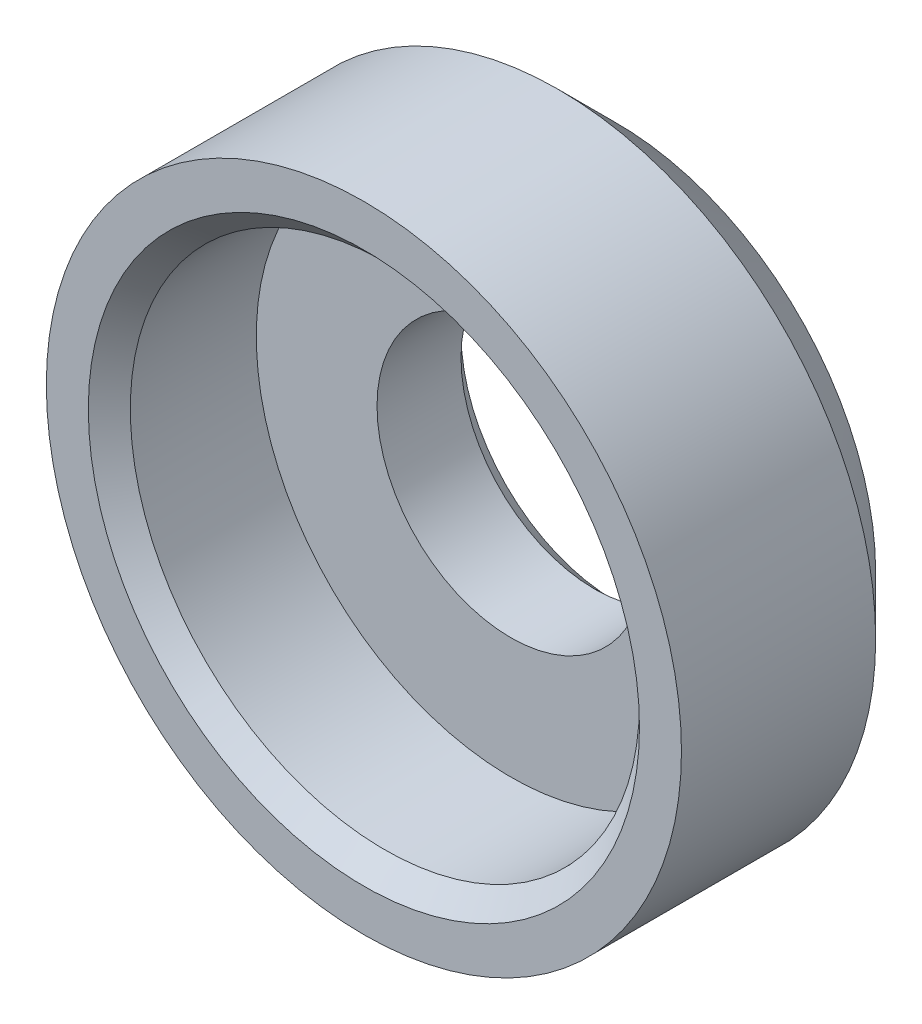
ISO-10303-21;
HEADER;
FILE_DESCRIPTION(('STEP AP214'),'2;1');
FILE_NAME('part.step','',(''),(''),'','','');
FILE_SCHEMA(('AUTOMOTIVE_DESIGN { 1 0 10303 214 1 1 1 1 }'));
ENDSEC;
DATA;
#1=APPLICATION_CONTEXT('core data for automotive mechanical design processes');
#2=APPLICATION_PROTOCOL_DEFINITION('international standard','automotive_design',2000,#1);
#3=PRODUCT_CONTEXT('',#1,'mechanical');
#4=PRODUCT('Part','Part','',(#3));
#5=PRODUCT_RELATED_PRODUCT_CATEGORY('part','',(#4));
#6=PRODUCT_DEFINITION_FORMATION('','',#4);
#7=PRODUCT_DEFINITION_CONTEXT('part definition',#1,'design');
#8=PRODUCT_DEFINITION('design','',#6,#7);
#9=PRODUCT_DEFINITION_SHAPE('','',#8);
#10=(LENGTH_UNIT() NAMED_UNIT(*) SI_UNIT(.MILLI.,.METRE.));
#11=(NAMED_UNIT(*) PLANE_ANGLE_UNIT() SI_UNIT($,.RADIAN.));
#12=(NAMED_UNIT(*) SI_UNIT($,.STERADIAN.) SOLID_ANGLE_UNIT());
#13=UNCERTAINTY_MEASURE_WITH_UNIT(LENGTH_MEASURE(1.E-05),#10,'distance_accuracy_value','');
#14=(GEOMETRIC_REPRESENTATION_CONTEXT(3) GLOBAL_UNCERTAINTY_ASSIGNED_CONTEXT((#13)) GLOBAL_UNIT_ASSIGNED_CONTEXT((#10,
#11,#12)) REPRESENTATION_CONTEXT('',''));
#15=CARTESIAN_POINT('',(0.,0.,0.));
#16=DIRECTION('',(0.,0.,1.));
#17=DIRECTION('',(1.,0.,0.));
#18=AXIS2_PLACEMENT_3D('',#15,#16,#17);
#19=CARTESIAN_POINT('',(0.,0.,2.));
#20=DIRECTION('',(0.,0.,1.));
#21=DIRECTION('',(1.,0.,0.));
#22=AXIS2_PLACEMENT_3D('',#19,#20,#21);
#23=PLANE('',#22);
#24=CARTESIAN_POINT('',(0.,0.,2.));
#25=DIRECTION('',(0.,0.,1.));
#26=DIRECTION('',(1.,0.,0.));
#27=AXIS2_PLACEMENT_3D('',#24,#25,#26);
#28=CIRCLE('',#27,2.55);
#29=CARTESIAN_POINT('',(2.55,0.,2.));
#30=VERTEX_POINT('',#29);
#31=EDGE_CURVE('E60',#30,#30,#28,.T.);
#32=ORIENTED_EDGE('',*,*,#31,.F.);
#33=EDGE_LOOP('',(#32));
#34=FACE_BOUND('',#33,.T.);
#35=CARTESIAN_POINT('',(0.,0.,2.));
#36=DIRECTION('',(0.,0.,1.));
#37=DIRECTION('',(1.,0.,0.));
#38=AXIS2_PLACEMENT_3D('',#35,#36,#37);
#39=CIRCLE('',#38,4.85);
#40=CARTESIAN_POINT('',(4.85,0.,2.));
#41=VERTEX_POINT('',#40);
#42=EDGE_CURVE('E54',#41,#41,#39,.F.);
#43=ORIENTED_EDGE('',*,*,#42,.F.);
#44=EDGE_LOOP('',(#43));
#45=FACE_BOUND('',#44,.T.);
#46=ADVANCED_FACE('F31',(#34,#45),#23,.T.);
#47=CARTESIAN_POINT('',(0.,0.,0.));
#48=DIRECTION('',(0.,0.,1.));
#49=DIRECTION('',(1.,0.,0.));
#50=AXIS2_PLACEMENT_3D('',#47,#48,#49);
#51=PLANE('',#50);
#52=CARTESIAN_POINT('',(0.,0.,0.));
#53=DIRECTION('',(0.,0.,1.));
#54=DIRECTION('',(1.,0.,0.));
#55=AXIS2_PLACEMENT_3D('',#52,#53,#54);
#56=CIRCLE('',#55,2.95);
#57=CARTESIAN_POINT('',(2.95,0.,0.));
#58=VERTEX_POINT('',#57);
#59=EDGE_CURVE('E46',#58,#58,#56,.T.);
#60=ORIENTED_EDGE('',*,*,#59,.T.);
#61=EDGE_LOOP('',(#60));
#62=FACE_BOUND('',#61,.T.);
#63=CARTESIAN_POINT('',(0.,0.,0.));
#64=DIRECTION('',(0.,0.,1.));
#65=DIRECTION('',(1.,0.,0.));
#66=AXIS2_PLACEMENT_3D('',#63,#64,#65);
#67=CIRCLE('',#66,4.95);
#68=CARTESIAN_POINT('',(4.95,0.,0.));
#69=VERTEX_POINT('',#68);
#70=EDGE_CURVE('E57',#69,#69,#67,.T.);
#71=ORIENTED_EDGE('',*,*,#70,.F.);
#72=EDGE_LOOP('',(#71));
#73=FACE_BOUND('',#72,.T.);
#74=ADVANCED_FACE('F84',(#62,#73),#51,.F.);
#75=CARTESIAN_POINT('',(0.,0.,2.));
#76=DIRECTION('',(0.,0.,-1.));
#77=DIRECTION('',(-1.,0.,0.));
#78=AXIS2_PLACEMENT_3D('',#75,#76,#77);
#79=CYLINDRICAL_SURFACE('',#78,2.55);
#80=CARTESIAN_POINT('',(0.,0.,0.400000000000001));
#81=DIRECTION('',(0.,0.,1.));
#82=DIRECTION('',(1.,0.,0.));
#83=AXIS2_PLACEMENT_3D('',#80,#81,#82);
#84=CIRCLE('',#83,2.55);
#85=CARTESIAN_POINT('',(2.55,0.,0.400000000000001));
#86=VERTEX_POINT('',#85);
#87=EDGE_CURVE('E42',#86,#86,#84,.F.);
#88=ORIENTED_EDGE('',*,*,#87,.T.);
#89=EDGE_LOOP('',(#88));
#90=FACE_BOUND('',#89,.T.);
#91=ORIENTED_EDGE('',*,*,#31,.T.);
#92=EDGE_LOOP('',(#91));
#93=FACE_BOUND('',#92,.T.);
#94=ADVANCED_FACE('F80',(#90,#93),#79,.F.);
#95=CARTESIAN_POINT('',(0.,0.,4.8));
#96=DIRECTION('',(0.,0.,1.));
#97=DIRECTION('',(1.,0.,0.));
#98=AXIS2_PLACEMENT_3D('',#95,#96,#97);
#99=PLANE('',#98);
#100=CARTESIAN_POINT('',(0.,0.,4.8));
#101=DIRECTION('',(0.,0.,1.));
#102=DIRECTION('',(1.,0.,0.));
#103=AXIS2_PLACEMENT_3D('',#100,#101,#102);
#104=CIRCLE('',#103,5.24999999999999);
#105=CARTESIAN_POINT('',(5.24999999999999,0.,4.8));
#106=VERTEX_POINT('',#105);
#107=EDGE_CURVE('E10',#106,#106,#104,.F.);
#108=ORIENTED_EDGE('',*,*,#107,.T.);
#109=EDGE_LOOP('',(#108));
#110=FACE_BOUND('',#109,.T.);
#111=CARTESIAN_POINT('',(0.,0.,4.8));
#112=DIRECTION('',(0.,0.,1.));
#113=DIRECTION('',(1.,0.,0.));
#114=AXIS2_PLACEMENT_3D('',#111,#112,#113);
#115=CIRCLE('',#114,6.05);
#116=CARTESIAN_POINT('',(6.05,0.,4.8));
#117=VERTEX_POINT('',#116);
#118=EDGE_CURVE('E63',#117,#117,#115,.T.);
#119=ORIENTED_EDGE('',*,*,#118,.T.);
#120=EDGE_LOOP('',(#119));
#121=FACE_BOUND('',#120,.T.);
#122=ADVANCED_FACE('F67',(#110,#121),#99,.T.);
#123=CARTESIAN_POINT('',(0.,0.,4.8));
#124=DIRECTION('',(0.,0.,-1.));
#125=DIRECTION('',(-1.,0.,0.));
#126=AXIS2_PLACEMENT_3D('',#123,#124,#125);
#127=CYLINDRICAL_SURFACE('',#126,6.05);
#128=CARTESIAN_POINT('',(0.,0.,1.09999999999997));
#129=DIRECTION('',(0.,0.,1.));
#130=DIRECTION('',(1.,0.,0.));
#131=AXIS2_PLACEMENT_3D('',#128,#129,#130);
#132=CIRCLE('',#131,6.05);
#133=CARTESIAN_POINT('',(6.05,0.,1.09999999999997));
#134=VERTEX_POINT('',#133);
#135=EDGE_CURVE('E51',#134,#134,#132,.T.);
#136=ORIENTED_EDGE('',*,*,#135,.T.);
#137=EDGE_LOOP('',(#136));
#138=FACE_BOUND('',#137,.T.);
#139=ORIENTED_EDGE('',*,*,#118,.F.);
#140=EDGE_LOOP('',(#139));
#141=FACE_BOUND('',#140,.T.);
#142=ADVANCED_FACE('F69',(#138,#141),#127,.T.);
#143=CARTESIAN_POINT('',(0.,0.,4.8));
#144=DIRECTION('',(0.,0.,-1.));
#145=DIRECTION('',(-1.,0.,0.));
#146=AXIS2_PLACEMENT_3D('',#143,#144,#145);
#147=CYLINDRICAL_SURFACE('',#146,4.85);
#148=CARTESIAN_POINT('',(0.,0.,4.40000000000001));
#149=DIRECTION('',(0.,0.,1.));
#150=DIRECTION('',(1.,0.,0.));
#151=AXIS2_PLACEMENT_3D('',#148,#149,#150);
#152=CIRCLE('',#151,4.85);
#153=CARTESIAN_POINT('',(4.85,0.,4.40000000000001));
#154=VERTEX_POINT('',#153);
#155=EDGE_CURVE('E38',#154,#154,#152,.T.);
#156=ORIENTED_EDGE('',*,*,#155,.T.);
#157=EDGE_LOOP('',(#156));
#158=FACE_BOUND('',#157,.T.);
#159=ORIENTED_EDGE('',*,*,#42,.T.);
#160=EDGE_LOOP('',(#159));
#161=FACE_BOUND('',#160,.T.);
#162=ADVANCED_FACE('F71',(#158,#161),#147,.F.);
#163=CARTESIAN_POINT('',(0.,0.,2.));
#164=DIRECTION('',(0.,0.,1.));
#165=DIRECTION('',(1.,0.,0.));
#166=AXIS2_PLACEMENT_3D('',#163,#164,#165);
#167=CONICAL_SURFACE('',#166,6.95000000000003,0.785398163397453);
#168=ORIENTED_EDGE('',*,*,#70,.T.);
#169=EDGE_LOOP('',(#168));
#170=FACE_BOUND('',#169,.T.);
#171=ORIENTED_EDGE('',*,*,#135,.F.);
#172=EDGE_LOOP('',(#171));
#173=FACE_BOUND('',#172,.T.);
#174=ADVANCED_FACE('F78',(#170,#173),#167,.T.);
#175=CARTESIAN_POINT('',(0.,0.,0.));
#176=DIRECTION('',(0.,0.,-1.));
#177=DIRECTION('',(-1.,0.,0.));
#178=AXIS2_PLACEMENT_3D('',#175,#176,#177);
#179=CONICAL_SURFACE('',#178,2.95,0.785398163397446);
#180=ORIENTED_EDGE('',*,*,#87,.F.);
#181=EDGE_LOOP('',(#180));
#182=FACE_BOUND('',#181,.T.);
#183=ORIENTED_EDGE('',*,*,#59,.F.);
#184=EDGE_LOOP('',(#183));
#185=FACE_BOUND('',#184,.T.);
#186=ADVANCED_FACE('F96',(#182,#185),#179,.F.);
#187=CARTESIAN_POINT('',(0.,0.,4.40000000000001));
#188=DIRECTION('',(0.,0.,1.));
#189=DIRECTION('',(1.,0.,0.));
#190=AXIS2_PLACEMENT_3D('',#187,#188,#189);
#191=CONICAL_SURFACE('',#190,4.85,0.785398163397455);
#192=ORIENTED_EDGE('',*,*,#107,.F.);
#193=EDGE_LOOP('',(#192));
#194=FACE_BOUND('',#193,.T.);
#195=ORIENTED_EDGE('',*,*,#155,.F.);
#196=EDGE_LOOP('',(#195));
#197=FACE_BOUND('',#196,.T.);
#198=ADVANCED_FACE('F33',(#194,#197),#191,.F.);
#199=CLOSED_SHELL('',(#46,#74,#94,#122,#142,#162,#174,#186,#198));
#200=MANIFOLD_SOLID_BREP('B2',#199);
#201=ADVANCED_BREP_SHAPE_REPRESENTATION('',(#18,#200),#14);
#202=SHAPE_DEFINITION_REPRESENTATION(#9,#201);
ENDSEC;
END-ISO-10303-21;
